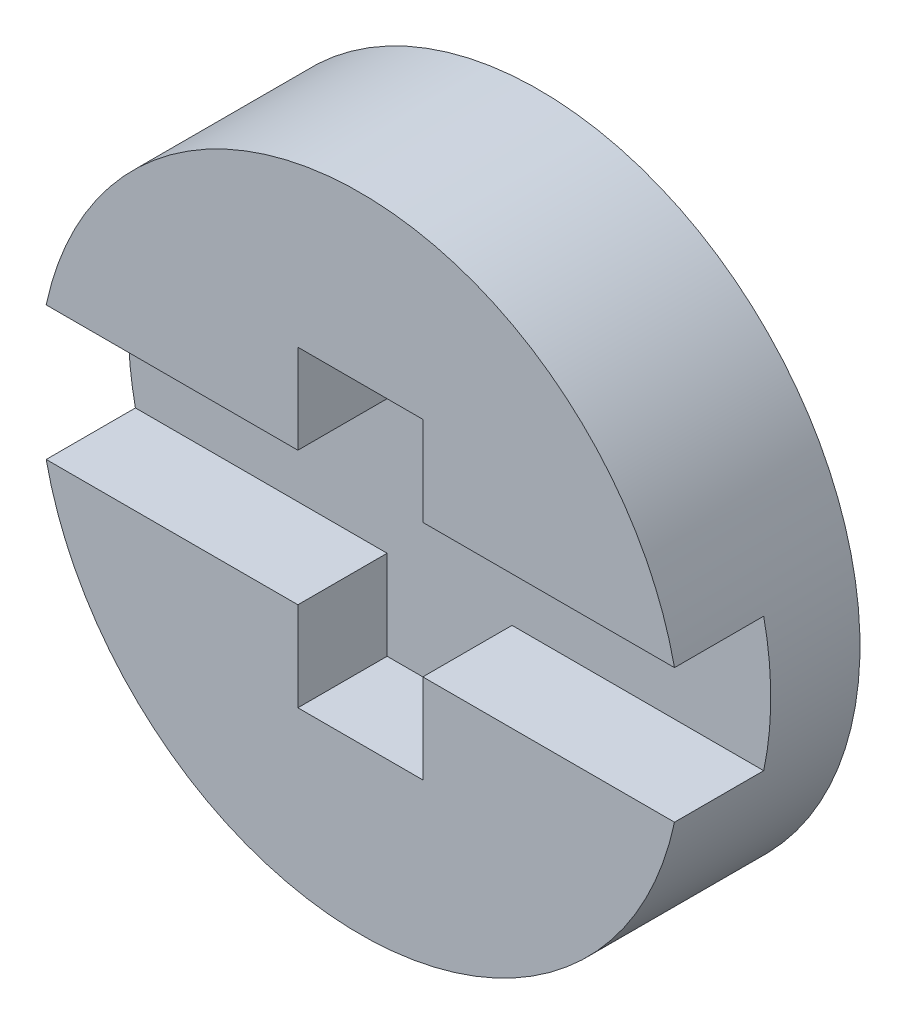
ISO-10303-21;
HEADER;
FILE_DESCRIPTION(('STEP AP214'),'2;1');
FILE_NAME('part.step','',(''),(''),'','','');
FILE_SCHEMA(('AUTOMOTIVE_DESIGN { 1 0 10303 214 1 1 1 1 }'));
ENDSEC;
DATA;
#1=APPLICATION_CONTEXT('core data for automotive mechanical design processes');
#2=APPLICATION_PROTOCOL_DEFINITION('international standard','automotive_design',2000,#1);
#3=PRODUCT_CONTEXT('',#1,'mechanical');
#4=PRODUCT('Part','Part','',(#3));
#5=PRODUCT_RELATED_PRODUCT_CATEGORY('part','',(#4));
#6=PRODUCT_DEFINITION_FORMATION('','',#4);
#7=PRODUCT_DEFINITION_CONTEXT('part definition',#1,'design');
#8=PRODUCT_DEFINITION('design','',#6,#7);
#9=PRODUCT_DEFINITION_SHAPE('','',#8);
#10=(LENGTH_UNIT() NAMED_UNIT(*) SI_UNIT(.MILLI.,.METRE.));
#11=(NAMED_UNIT(*) PLANE_ANGLE_UNIT() SI_UNIT($,.RADIAN.));
#12=(NAMED_UNIT(*) SI_UNIT($,.STERADIAN.) SOLID_ANGLE_UNIT());
#13=UNCERTAINTY_MEASURE_WITH_UNIT(LENGTH_MEASURE(1.E-05),#10,'distance_accuracy_value','');
#14=(GEOMETRIC_REPRESENTATION_CONTEXT(3) GLOBAL_UNCERTAINTY_ASSIGNED_CONTEXT((#13)) GLOBAL_UNIT_ASSIGNED_CONTEXT((#10,
#11,#12)) REPRESENTATION_CONTEXT('',''));
#15=CARTESIAN_POINT('',(0.,0.,0.));
#16=DIRECTION('',(0.,0.,1.));
#17=DIRECTION('',(1.,0.,0.));
#18=AXIS2_PLACEMENT_3D('',#15,#16,#17);
#19=CARTESIAN_POINT('',(9.350063098956,77.31912593735,-29.13542042992));
#20=DIRECTION('',(0.,0.,1.));
#21=DIRECTION('',(1.,0.,0.));
#22=AXIS2_PLACEMENT_3D('',#19,#20,#21);
#23=PLANE('',#22);
#24=DIRECTION('',(1.,0.,0.));
#25=VECTOR('',#24,1.);
#26=CARTESIAN_POINT('',(10.050063098956,76.56912593735,-29.13542042992));
#27=LINE('',#26,#25);
#28=CARTESIAN_POINT('',(10.050063098956,76.56912593735,-29.13542042992));
#29=VERTEX_POINT('',#28);
#30=CARTESIAN_POINT('',(12.8710714772478,76.56912593735,-29.13542042992));
#31=VERTEX_POINT('',#30);
#32=EDGE_CURVE('E87',#29,#31,#27,.T.);
#33=ORIENTED_EDGE('',*,*,#32,.T.);
#34=CARTESIAN_POINT('',(9.350063098956,77.31912593735,-29.13542042992));
#35=DIRECTION('',(0.,0.,-1.));
#36=DIRECTION('',(-1.,0.,0.));
#37=AXIS2_PLACEMENT_3D('',#34,#35,#36);
#38=CIRCLE('',#37,3.6);
#39=CARTESIAN_POINT('',(12.8710714772478,78.06912593735,-29.13542042992));
#40=VERTEX_POINT('',#39);
#41=EDGE_CURVE('E95',#31,#40,#38,.F.);
#42=ORIENTED_EDGE('',*,*,#41,.T.);
#43=DIRECTION('',(1.,0.,0.));
#44=VECTOR('',#43,1.);
#45=CARTESIAN_POINT('',(14.881802433228,78.06912593735,-29.13542042992));
#46=LINE('',#45,#44);
#47=CARTESIAN_POINT('',(10.050063098956,78.06912593735,-29.13542042992));
#48=VERTEX_POINT('',#47);
#49=EDGE_CURVE('E122',#40,#48,#46,.F.);
#50=ORIENTED_EDGE('',*,*,#49,.T.);
#51=DIRECTION('',(0.,1.,0.));
#52=VECTOR('',#51,1.);
#53=CARTESIAN_POINT('',(10.050063098956,78.06912593735,-29.13542042992));
#54=LINE('',#53,#52);
#55=CARTESIAN_POINT('',(10.050063098956,79.06912593735,-29.13542042992));
#56=VERTEX_POINT('',#55);
#57=EDGE_CURVE('E134',#48,#56,#54,.T.);
#58=ORIENTED_EDGE('',*,*,#57,.T.);
#59=DIRECTION('',(1.,0.,0.));
#60=VECTOR('',#59,1.);
#61=CARTESIAN_POINT('',(10.050063098956,79.06912593735,-29.13542042992));
#62=LINE('',#61,#60);
#63=CARTESIAN_POINT('',(8.650063098956,79.06912593735,-29.13542042992));
#64=VERTEX_POINT('',#63);
#65=EDGE_CURVE('E160',#56,#64,#62,.F.);
#66=ORIENTED_EDGE('',*,*,#65,.T.);
#67=DIRECTION('',(0.,1.,0.));
#68=VECTOR('',#67,1.);
#69=CARTESIAN_POINT('',(8.650063098956,79.06912593735,-29.13542042992));
#70=LINE('',#69,#68);
#71=CARTESIAN_POINT('',(8.650063098956,78.06912593735,-29.13542042992));
#72=VERTEX_POINT('',#71);
#73=EDGE_CURVE('E171',#64,#72,#70,.F.);
#74=ORIENTED_EDGE('',*,*,#73,.T.);
#75=DIRECTION('',(1.,0.,0.));
#76=VECTOR('',#75,1.);
#77=CARTESIAN_POINT('',(8.650063098956,78.06912593735,-29.13542042992));
#78=LINE('',#77,#76);
#79=CARTESIAN_POINT('',(5.82905472066417,78.06912593735,-29.13542042992));
#80=VERTEX_POINT('',#79);
#81=EDGE_CURVE('E176',#72,#80,#78,.F.);
#82=ORIENTED_EDGE('',*,*,#81,.T.);
#83=CARTESIAN_POINT('',(9.350063098956,77.31912593735,-29.13542042992));
#84=DIRECTION('',(0.,0.,-1.));
#85=DIRECTION('',(-1.,0.,0.));
#86=AXIS2_PLACEMENT_3D('',#83,#84,#85);
#87=CIRCLE('',#86,3.6);
#88=CARTESIAN_POINT('',(5.82905472066417,76.56912593735,-29.13542042992));
#89=VERTEX_POINT('',#88);
#90=EDGE_CURVE('E19',#80,#89,#87,.F.);
#91=ORIENTED_EDGE('',*,*,#90,.T.);
#92=DIRECTION('',(1.,0.,0.));
#93=VECTOR('',#92,1.);
#94=CARTESIAN_POINT('',(3.02807528836,76.56912593735,-29.13542042992));
#95=LINE('',#94,#93);
#96=CARTESIAN_POINT('',(8.650063098956,76.56912593735,-29.13542042992));
#97=VERTEX_POINT('',#96);
#98=EDGE_CURVE('E180',#89,#97,#95,.T.);
#99=ORIENTED_EDGE('',*,*,#98,.T.);
#100=DIRECTION('',(0.,1.,0.));
#101=VECTOR('',#100,1.);
#102=CARTESIAN_POINT('',(8.650063098956,76.56912593735,-29.13542042992));
#103=LINE('',#102,#101);
#104=CARTESIAN_POINT('',(8.650063098956,75.56912593735,-29.13542042992));
#105=VERTEX_POINT('',#104);
#106=EDGE_CURVE('E195',#97,#105,#103,.F.);
#107=ORIENTED_EDGE('',*,*,#106,.T.);
#108=DIRECTION('',(1.,0.,0.));
#109=VECTOR('',#108,1.);
#110=CARTESIAN_POINT('',(8.650063098956,75.56912593735,-29.13542042992));
#111=LINE('',#110,#109);
#112=CARTESIAN_POINT('',(10.050063098956,75.56912593735,-29.13542042992));
#113=VERTEX_POINT('',#112);
#114=EDGE_CURVE('E73',#105,#113,#111,.T.);
#115=ORIENTED_EDGE('',*,*,#114,.T.);
#116=DIRECTION('',(0.,1.,0.));
#117=VECTOR('',#116,1.);
#118=CARTESIAN_POINT('',(10.050063098956,75.56912593735,-29.13542042992));
#119=LINE('',#118,#117);
#120=EDGE_CURVE('E100',#113,#29,#119,.T.);
#121=ORIENTED_EDGE('',*,*,#120,.T.);
#122=EDGE_LOOP('',(#33,#42,#50,#58,#66,#74,#82,#91,#99,#107,#115,#121));
#123=FACE_BOUND('',#122,.T.);
#124=ADVANCED_FACE('F16',(#123),#23,.T.);
#125=CARTESIAN_POINT('',(10.050063098956,76.56912593735,-28.13542042992));
#126=DIRECTION('',(0.,-1.,0.));
#127=DIRECTION('',(0.,0.,-1.));
#128=AXIS2_PLACEMENT_3D('',#125,#126,#127);
#129=PLANE('',#128);
#130=ORIENTED_EDGE('',*,*,#32,.F.);
#131=DIRECTION('',(0.,0.,-1.));
#132=VECTOR('',#131,1.);
#133=CARTESIAN_POINT('',(10.050063098956,76.56912593735,-28.13542042992));
#134=LINE('',#133,#132);
#135=CARTESIAN_POINT('',(10.050063098956,76.56912593735,-28.13542042992));
#136=VERTEX_POINT('',#135);
#137=EDGE_CURVE('E91',#29,#136,#134,.F.);
#138=ORIENTED_EDGE('',*,*,#137,.T.);
#139=DIRECTION('',(1.,0.,0.));
#140=VECTOR('',#139,1.);
#141=CARTESIAN_POINT('',(9.350063098956,76.56912593735,-28.13542042992));
#142=LINE('',#141,#140);
#143=CARTESIAN_POINT('',(12.8710714772478,76.56912593735,-28.13542042992));
#144=VERTEX_POINT('',#143);
#145=EDGE_CURVE('E141',#144,#136,#142,.F.);
#146=ORIENTED_EDGE('',*,*,#145,.F.);
#147=DIRECTION('',(0.,0.,-1.));
#148=VECTOR('',#147,1.);
#149=CARTESIAN_POINT('',(12.871071477248,76.56912593735,-28.13542042992));
#150=LINE('',#149,#148);
#151=EDGE_CURVE('E93',#31,#144,#150,.F.);
#152=ORIENTED_EDGE('',*,*,#151,.F.);
#153=EDGE_LOOP('',(#130,#138,#146,#152));
#154=FACE_BOUND('',#153,.T.);
#155=ADVANCED_FACE('F89',(#154),#129,.F.);
#156=CARTESIAN_POINT('',(10.050063098956,75.56912593735,-28.13542042992));
#157=DIRECTION('',(1.,0.,0.));
#158=DIRECTION('',(0.,0.,-1.));
#159=AXIS2_PLACEMENT_3D('',#156,#157,#158);
#160=PLANE('',#159);
#161=ORIENTED_EDGE('',*,*,#120,.F.);
#162=DIRECTION('',(0.,0.,-1.));
#163=VECTOR('',#162,1.);
#164=CARTESIAN_POINT('',(10.050063098956,75.56912593735,-28.13542042992));
#165=LINE('',#164,#163);
#166=CARTESIAN_POINT('',(10.050063098956,75.56912593735,-28.13542042992));
#167=VERTEX_POINT('',#166);
#168=EDGE_CURVE('E202',#113,#167,#165,.F.);
#169=ORIENTED_EDGE('',*,*,#168,.T.);
#170=DIRECTION('',(0.,1.,0.));
#171=VECTOR('',#170,1.);
#172=CARTESIAN_POINT('',(10.050063098956,77.31912593735,-28.13542042992));
#173=LINE('',#172,#171);
#174=EDGE_CURVE('E102',#136,#167,#173,.F.);
#175=ORIENTED_EDGE('',*,*,#174,.F.);
#176=ORIENTED_EDGE('',*,*,#137,.F.);
#177=EDGE_LOOP('',(#161,#169,#175,#176));
#178=FACE_BOUND('',#177,.T.);
#179=ADVANCED_FACE('F98',(#178),#160,.F.);
#180=CARTESIAN_POINT('',(8.650063098956,75.56912593735,-28.13542042992));
#181=DIRECTION('',(0.,-1.,0.));
#182=DIRECTION('',(0.,0.,-1.));
#183=AXIS2_PLACEMENT_3D('',#180,#181,#182);
#184=PLANE('',#183);
#185=ORIENTED_EDGE('',*,*,#114,.F.);
#186=DIRECTION('',(0.,0.,1.));
#187=VECTOR('',#186,1.);
#188=CARTESIAN_POINT('',(8.650063098956,75.56912593735,-28.13542042992));
#189=LINE('',#188,#187);
#190=CARTESIAN_POINT('',(8.650063098956,75.56912593735,-28.13542042992));
#191=VERTEX_POINT('',#190);
#192=EDGE_CURVE('E181',#105,#191,#189,.T.);
#193=ORIENTED_EDGE('',*,*,#192,.T.);
#194=DIRECTION('',(1.,0.,0.));
#195=VECTOR('',#194,1.);
#196=CARTESIAN_POINT('',(9.350063098956,75.56912593735,-28.13542042992));
#197=LINE('',#196,#195);
#198=EDGE_CURVE('E191',#167,#191,#197,.F.);
#199=ORIENTED_EDGE('',*,*,#198,.F.);
#200=ORIENTED_EDGE('',*,*,#168,.F.);
#201=EDGE_LOOP('',(#185,#193,#199,#200));
#202=FACE_BOUND('',#201,.T.);
#203=ADVANCED_FACE('F277',(#202),#184,.F.);
#204=CARTESIAN_POINT('',(8.650063098956,76.56912593735,-28.13542042992));
#205=DIRECTION('',(-1.,0.,0.));
#206=DIRECTION('',(0.,0.,1.));
#207=AXIS2_PLACEMENT_3D('',#204,#205,#206);
#208=PLANE('',#207);
#209=ORIENTED_EDGE('',*,*,#106,.F.);
#210=DIRECTION('',(0.,0.,-1.));
#211=VECTOR('',#210,1.);
#212=CARTESIAN_POINT('',(8.650063098956,76.56912593735,-28.13542042992));
#213=LINE('',#212,#211);
#214=CARTESIAN_POINT('',(8.650063098956,76.56912593735,-28.13542042992));
#215=VERTEX_POINT('',#214);
#216=EDGE_CURVE('E182',#97,#215,#213,.F.);
#217=ORIENTED_EDGE('',*,*,#216,.T.);
#218=DIRECTION('',(0.,1.,0.));
#219=VECTOR('',#218,1.);
#220=CARTESIAN_POINT('',(8.650063098956,77.31912593735,-28.13542042992));
#221=LINE('',#220,#219);
#222=EDGE_CURVE('E187',#191,#215,#221,.T.);
#223=ORIENTED_EDGE('',*,*,#222,.F.);
#224=ORIENTED_EDGE('',*,*,#192,.F.);
#225=EDGE_LOOP('',(#209,#217,#223,#224));
#226=FACE_BOUND('',#225,.T.);
#227=ADVANCED_FACE('F279',(#226),#208,.F.);
#228=CARTESIAN_POINT('',(3.02807528836,76.56912593735,-28.13542042992));
#229=DIRECTION('',(0.,-1.,0.));
#230=DIRECTION('',(0.,0.,-1.));
#231=AXIS2_PLACEMENT_3D('',#228,#229,#230);
#232=PLANE('',#231);
#233=ORIENTED_EDGE('',*,*,#98,.F.);
#234=DIRECTION('',(0.,0.,-1.));
#235=VECTOR('',#234,1.);
#236=CARTESIAN_POINT('',(5.829054720664,76.56912593735,-28.13542042992));
#237=LINE('',#236,#235);
#238=CARTESIAN_POINT('',(5.82905472066417,76.56912593735,-28.13542042992));
#239=VERTEX_POINT('',#238);
#240=EDGE_CURVE('E177',#239,#89,#237,.T.);
#241=ORIENTED_EDGE('',*,*,#240,.F.);
#242=DIRECTION('',(1.,0.,0.));
#243=VECTOR('',#242,1.);
#244=CARTESIAN_POINT('',(9.350063098956,76.56912593735,-28.13542042992));
#245=LINE('',#244,#243);
#246=EDGE_CURVE('E190',#215,#239,#245,.F.);
#247=ORIENTED_EDGE('',*,*,#246,.F.);
#248=ORIENTED_EDGE('',*,*,#216,.F.);
#249=EDGE_LOOP('',(#233,#241,#247,#248));
#250=FACE_BOUND('',#249,.T.);
#251=ADVANCED_FACE('F234',(#250),#232,.F.);
#252=CARTESIAN_POINT('',(8.650063098956,78.06912593735,-28.13542042992));
#253=DIRECTION('',(0.,1.,0.));
#254=DIRECTION('',(0.,0.,1.));
#255=AXIS2_PLACEMENT_3D('',#252,#253,#254);
#256=PLANE('',#255);
#257=ORIENTED_EDGE('',*,*,#81,.F.);
#258=DIRECTION('',(0.,0.,1.));
#259=VECTOR('',#258,1.);
#260=CARTESIAN_POINT('',(8.650063098956,78.06912593735,-28.13542042992));
#261=LINE('',#260,#259);
#262=CARTESIAN_POINT('',(8.650063098956,78.06912593735,-28.13542042992));
#263=VERTEX_POINT('',#262);
#264=EDGE_CURVE('E168',#72,#263,#261,.T.);
#265=ORIENTED_EDGE('',*,*,#264,.T.);
#266=DIRECTION('',(1.,0.,0.));
#267=VECTOR('',#266,1.);
#268=CARTESIAN_POINT('',(9.350063098956,78.06912593735,-28.13542042992));
#269=LINE('',#268,#267);
#270=CARTESIAN_POINT('',(5.82905472066417,78.06912593735,-28.13542042992));
#271=VERTEX_POINT('',#270);
#272=EDGE_CURVE('E165',#271,#263,#269,.T.);
#273=ORIENTED_EDGE('',*,*,#272,.F.);
#274=DIRECTION('',(0.,0.,1.));
#275=VECTOR('',#274,1.);
#276=CARTESIAN_POINT('',(5.829054720664,78.06912593735,-28.13542042992));
#277=LINE('',#276,#275);
#278=EDGE_CURVE('E174',#80,#271,#277,.T.);
#279=ORIENTED_EDGE('',*,*,#278,.F.);
#280=EDGE_LOOP('',(#257,#265,#273,#279));
#281=FACE_BOUND('',#280,.T.);
#282=ADVANCED_FACE('F287',(#281),#256,.F.);
#283=CARTESIAN_POINT('',(8.650063098956,79.06912593735,-28.13542042992));
#284=DIRECTION('',(-1.,0.,0.));
#285=DIRECTION('',(0.,0.,1.));
#286=AXIS2_PLACEMENT_3D('',#283,#284,#285);
#287=PLANE('',#286);
#288=ORIENTED_EDGE('',*,*,#73,.F.);
#289=DIRECTION('',(0.,0.,1.));
#290=VECTOR('',#289,1.);
#291=CARTESIAN_POINT('',(8.650063098956,79.06912593735,-28.13542042992));
#292=LINE('',#291,#290);
#293=CARTESIAN_POINT('',(8.650063098956,79.06912593735,-28.13542042992));
#294=VERTEX_POINT('',#293);
#295=EDGE_CURVE('E157',#64,#294,#292,.T.);
#296=ORIENTED_EDGE('',*,*,#295,.T.);
#297=DIRECTION('',(0.,1.,0.));
#298=VECTOR('',#297,1.);
#299=CARTESIAN_POINT('',(8.650063098956,77.31912593735,-28.13542042992));
#300=LINE('',#299,#298);
#301=EDGE_CURVE('E154',#263,#294,#300,.T.);
#302=ORIENTED_EDGE('',*,*,#301,.F.);
#303=ORIENTED_EDGE('',*,*,#264,.F.);
#304=EDGE_LOOP('',(#288,#296,#302,#303));
#305=FACE_BOUND('',#304,.T.);
#306=ADVANCED_FACE('F314',(#305),#287,.F.);
#307=CARTESIAN_POINT('',(10.050063098956,79.06912593735,-28.13542042992));
#308=DIRECTION('',(0.,1.,0.));
#309=DIRECTION('',(0.,0.,1.));
#310=AXIS2_PLACEMENT_3D('',#307,#308,#309);
#311=PLANE('',#310);
#312=ORIENTED_EDGE('',*,*,#65,.F.);
#313=DIRECTION('',(0.,0.,-1.));
#314=VECTOR('',#313,1.);
#315=CARTESIAN_POINT('',(10.050063098956,79.06912593735,-28.13542042992));
#316=LINE('',#315,#314);
#317=CARTESIAN_POINT('',(10.050063098956,79.06912593735,-28.13542042992));
#318=VERTEX_POINT('',#317);
#319=EDGE_CURVE('E131',#56,#318,#316,.F.);
#320=ORIENTED_EDGE('',*,*,#319,.T.);
#321=DIRECTION('',(1.,0.,0.));
#322=VECTOR('',#321,1.);
#323=CARTESIAN_POINT('',(9.350063098956,79.06912593735,-28.13542042992));
#324=LINE('',#323,#322);
#325=EDGE_CURVE('E147',#294,#318,#324,.T.);
#326=ORIENTED_EDGE('',*,*,#325,.F.);
#327=ORIENTED_EDGE('',*,*,#295,.F.);
#328=EDGE_LOOP('',(#312,#320,#326,#327));
#329=FACE_BOUND('',#328,.T.);
#330=ADVANCED_FACE('F310',(#329),#311,.F.);
#331=CARTESIAN_POINT('',(10.050063098956,78.06912593735,-28.13542042992));
#332=DIRECTION('',(1.,0.,0.));
#333=DIRECTION('',(0.,0.,-1.));
#334=AXIS2_PLACEMENT_3D('',#331,#332,#333);
#335=PLANE('',#334);
#336=ORIENTED_EDGE('',*,*,#57,.F.);
#337=DIRECTION('',(0.,0.,1.));
#338=VECTOR('',#337,1.);
#339=CARTESIAN_POINT('',(10.050063098956,78.06912593735,-28.13542042992));
#340=LINE('',#339,#338);
#341=CARTESIAN_POINT('',(10.050063098956,78.06912593735,-28.13542042992));
#342=VERTEX_POINT('',#341);
#343=EDGE_CURVE('E127',#48,#342,#340,.T.);
#344=ORIENTED_EDGE('',*,*,#343,.T.);
#345=DIRECTION('',(0.,1.,0.));
#346=VECTOR('',#345,1.);
#347=CARTESIAN_POINT('',(10.050063098956,77.31912593735,-28.13542042992));
#348=LINE('',#347,#346);
#349=EDGE_CURVE('E144',#318,#342,#348,.F.);
#350=ORIENTED_EDGE('',*,*,#349,.F.);
#351=ORIENTED_EDGE('',*,*,#319,.F.);
#352=EDGE_LOOP('',(#336,#344,#350,#351));
#353=FACE_BOUND('',#352,.T.);
#354=ADVANCED_FACE('F307',(#353),#335,.F.);
#355=CARTESIAN_POINT('',(14.881802433228,78.06912593735,-28.13542042992));
#356=DIRECTION('',(0.,1.,0.));
#357=DIRECTION('',(0.,0.,1.));
#358=AXIS2_PLACEMENT_3D('',#355,#356,#357);
#359=PLANE('',#358);
#360=ORIENTED_EDGE('',*,*,#49,.F.);
#361=DIRECTION('',(0.,0.,1.));
#362=VECTOR('',#361,1.);
#363=CARTESIAN_POINT('',(12.871071477248,78.06912593735,-28.13542042992));
#364=LINE('',#363,#362);
#365=CARTESIAN_POINT('',(12.8710714772478,78.06912593735,-28.13542042992));
#366=VERTEX_POINT('',#365);
#367=EDGE_CURVE('E34',#366,#40,#364,.F.);
#368=ORIENTED_EDGE('',*,*,#367,.F.);
#369=DIRECTION('',(1.,0.,0.));
#370=VECTOR('',#369,1.);
#371=CARTESIAN_POINT('',(9.350063098956,78.06912593735,-28.13542042992));
#372=LINE('',#371,#370);
#373=EDGE_CURVE('E119',#342,#366,#372,.T.);
#374=ORIENTED_EDGE('',*,*,#373,.F.);
#375=ORIENTED_EDGE('',*,*,#343,.F.);
#376=EDGE_LOOP('',(#360,#368,#374,#375));
#377=FACE_BOUND('',#376,.T.);
#378=ADVANCED_FACE('F125',(#377),#359,.F.);
#379=CARTESIAN_POINT('',(9.350063098956,77.31912593735,-28.13542042992));
#380=DIRECTION('',(0.,0.,1.));
#381=DIRECTION('',(1.,0.,0.));
#382=AXIS2_PLACEMENT_3D('',#379,#380,#381);
#383=PLANE('',#382);
#384=ORIENTED_EDGE('',*,*,#246,.T.);
#385=CARTESIAN_POINT('',(9.350063098956,77.31912593735,-28.13542042992));
#386=DIRECTION('',(0.,0.,-1.));
#387=DIRECTION('',(-1.,0.,0.));
#388=AXIS2_PLACEMENT_3D('',#385,#386,#387);
#389=CIRCLE('',#388,3.6);
#390=EDGE_CURVE('E117',#144,#239,#389,.T.);
#391=ORIENTED_EDGE('',*,*,#390,.F.);
#392=ORIENTED_EDGE('',*,*,#145,.T.);
#393=ORIENTED_EDGE('',*,*,#174,.T.);
#394=ORIENTED_EDGE('',*,*,#198,.T.);
#395=ORIENTED_EDGE('',*,*,#222,.T.);
#396=EDGE_LOOP('',(#384,#391,#392,#393,#394,#395));
#397=FACE_BOUND('',#396,.T.);
#398=ADVANCED_FACE('F240',(#397),#383,.T.);
#399=CARTESIAN_POINT('',(9.350063098956,77.31912593735,-28.13542042992));
#400=DIRECTION('',(0.,0.,1.));
#401=DIRECTION('',(1.,0.,0.));
#402=AXIS2_PLACEMENT_3D('',#399,#400,#401);
#403=PLANE('',#402);
#404=ORIENTED_EDGE('',*,*,#373,.T.);
#405=CARTESIAN_POINT('',(9.350063098956,77.31912593735,-28.13542042992));
#406=DIRECTION('',(0.,0.,-1.));
#407=DIRECTION('',(-1.,0.,0.));
#408=AXIS2_PLACEMENT_3D('',#405,#406,#407);
#409=CIRCLE('',#408,3.6);
#410=EDGE_CURVE('E25',#271,#366,#409,.T.);
#411=ORIENTED_EDGE('',*,*,#410,.F.);
#412=ORIENTED_EDGE('',*,*,#272,.T.);
#413=ORIENTED_EDGE('',*,*,#301,.T.);
#414=ORIENTED_EDGE('',*,*,#325,.T.);
#415=ORIENTED_EDGE('',*,*,#349,.T.);
#416=EDGE_LOOP('',(#404,#411,#412,#413,#414,#415));
#417=FACE_BOUND('',#416,.T.);
#418=ADVANCED_FACE('F254',(#417),#403,.T.);
#419=CARTESIAN_POINT('',(9.350063098956,77.31912593735,-30.13542042992));
#420=DIRECTION('',(0.,0.,-1.));
#421=DIRECTION('',(-1.,0.,0.));
#422=AXIS2_PLACEMENT_3D('',#419,#420,#421);
#423=CYLINDRICAL_SURFACE('',#422,3.6);
#424=CARTESIAN_POINT('',(9.350063098956,77.31912593735,-30.13542042992));
#425=DIRECTION('',(0.,0.,-1.));
#426=DIRECTION('',(-1.,0.,0.));
#427=AXIS2_PLACEMENT_3D('',#424,#425,#426);
#428=CIRCLE('',#427,3.6);
#429=CARTESIAN_POINT('',(5.750063098956,77.31912593735,-30.13542042992));
#430=VERTEX_POINT('',#429);
#431=EDGE_CURVE('E11',#430,#430,#428,.F.);
#432=ORIENTED_EDGE('',*,*,#431,.T.);
#433=EDGE_LOOP('',(#432));
#434=FACE_BOUND('',#433,.T.);
#435=ORIENTED_EDGE('',*,*,#367,.T.);
#436=ORIENTED_EDGE('',*,*,#41,.F.);
#437=ORIENTED_EDGE('',*,*,#151,.T.);
#438=ORIENTED_EDGE('',*,*,#390,.T.);
#439=ORIENTED_EDGE('',*,*,#240,.T.);
#440=ORIENTED_EDGE('',*,*,#90,.F.);
#441=ORIENTED_EDGE('',*,*,#278,.T.);
#442=ORIENTED_EDGE('',*,*,#410,.T.);
#443=EDGE_LOOP('',(#435,#436,#437,#438,#439,#440,#441,#442));
#444=FACE_BOUND('',#443,.T.);
#445=ADVANCED_FACE('F129',(#434,#444),#423,.T.);
#446=CARTESIAN_POINT('',(9.350063098956,77.31912593735,-30.13542042992));
#447=DIRECTION('',(0.,0.,1.));
#448=DIRECTION('',(1.,0.,0.));
#449=AXIS2_PLACEMENT_3D('',#446,#447,#448);
#450=PLANE('',#449);
#451=ORIENTED_EDGE('',*,*,#431,.F.);
#452=EDGE_LOOP('',(#451));
#453=FACE_BOUND('',#452,.T.);
#454=ADVANCED_FACE('F290',(#453),#450,.F.);
#455=CLOSED_SHELL('',(#124,#155,#179,#203,#227,#251,#282,#306,#330,#354,#378,#398,#418,#445,#454));
#456=MANIFOLD_SOLID_BREP('B1',#455);
#457=ADVANCED_BREP_SHAPE_REPRESENTATION('',(#18,#456),#14);
#458=SHAPE_DEFINITION_REPRESENTATION(#9,#457);
ENDSEC;
END-ISO-10303-21;
